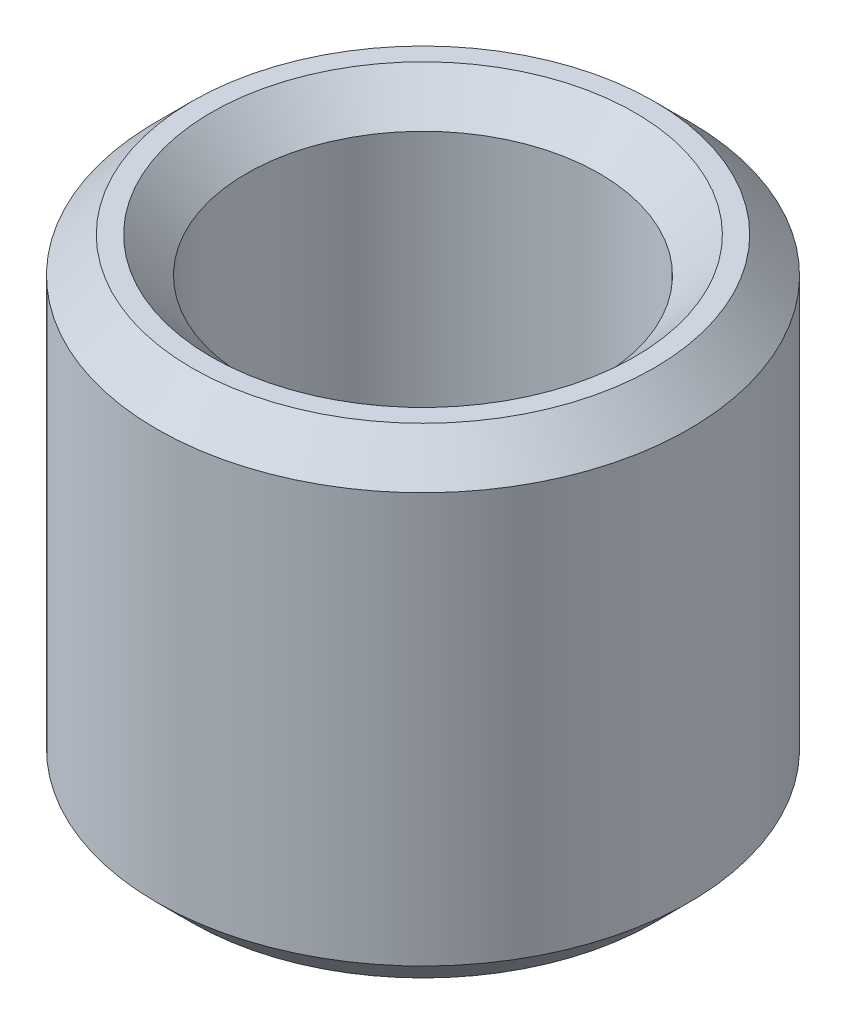
ISO-10303-21;
HEADER;
FILE_DESCRIPTION(('STEP AP214'),'2;1');
FILE_NAME('part.step','',(''),(''),'','','');
FILE_SCHEMA(('AUTOMOTIVE_DESIGN { 1 0 10303 214 1 1 1 1 }'));
ENDSEC;
DATA;
#1=APPLICATION_CONTEXT('core data for automotive mechanical design processes');
#2=APPLICATION_PROTOCOL_DEFINITION('international standard','automotive_design',2000,#1);
#3=PRODUCT_CONTEXT('',#1,'mechanical');
#4=PRODUCT('Part','Part','',(#3));
#5=PRODUCT_RELATED_PRODUCT_CATEGORY('part','',(#4));
#6=PRODUCT_DEFINITION_FORMATION('','',#4);
#7=PRODUCT_DEFINITION_CONTEXT('part definition',#1,'design');
#8=PRODUCT_DEFINITION('design','',#6,#7);
#9=PRODUCT_DEFINITION_SHAPE('','',#8);
#10=(LENGTH_UNIT() NAMED_UNIT(*) SI_UNIT(.MILLI.,.METRE.));
#11=(NAMED_UNIT(*) PLANE_ANGLE_UNIT() SI_UNIT($,.RADIAN.));
#12=(NAMED_UNIT(*) SI_UNIT($,.STERADIAN.) SOLID_ANGLE_UNIT());
#13=UNCERTAINTY_MEASURE_WITH_UNIT(LENGTH_MEASURE(1.E-05),#10,'distance_accuracy_value','');
#14=(GEOMETRIC_REPRESENTATION_CONTEXT(3) GLOBAL_UNCERTAINTY_ASSIGNED_CONTEXT((#13)) GLOBAL_UNIT_ASSIGNED_CONTEXT((#10,
#11,#12)) REPRESENTATION_CONTEXT('',''));
#15=CARTESIAN_POINT('',(0.,0.,0.));
#16=DIRECTION('',(0.,0.,1.));
#17=DIRECTION('',(1.,0.,0.));
#18=AXIS2_PLACEMENT_3D('',#15,#16,#17);
#19=CARTESIAN_POINT('',(0.,27.0609419100916,0.));
#20=DIRECTION('',(0.,-1.,0.));
#21=DIRECTION('',(0.,0.,-1.));
#22=AXIS2_PLACEMENT_3D('',#19,#20,#21);
#23=CYLINDRICAL_SURFACE('',#22,15.);
#24=CARTESIAN_POINT('',(0.,1.9852717542668,0.));
#25=DIRECTION('',(0.,1.,0.));
#26=DIRECTION('',(0.,0.,1.));
#27=AXIS2_PLACEMENT_3D('',#24,#25,#26);
#28=CIRCLE('',#27,15.);
#29=CARTESIAN_POINT('',(0.,1.9852717542668,15.));
#30=VERTEX_POINT('',#29);
#31=EDGE_CURVE('E10',#30,#30,#28,.T.);
#32=ORIENTED_EDGE('',*,*,#31,.T.);
#33=EDGE_LOOP('',(#32));
#34=FACE_BOUND('',#33,.T.);
#35=CARTESIAN_POINT('',(0.,25.0756701558248,0.));
#36=DIRECTION('',(0.,1.,0.));
#37=DIRECTION('',(0.,0.,1.));
#38=AXIS2_PLACEMENT_3D('',#35,#36,#37);
#39=CIRCLE('',#38,15.);
#40=CARTESIAN_POINT('',(0.,25.0756701558248,15.));
#41=VERTEX_POINT('',#40);
#42=EDGE_CURVE('E50',#41,#41,#39,.F.);
#43=ORIENTED_EDGE('',*,*,#42,.T.);
#44=EDGE_LOOP('',(#43));
#45=FACE_BOUND('',#44,.T.);
#46=ADVANCED_FACE('F39',(#34,#45),#23,.T.);
#47=CARTESIAN_POINT('',(0.,27.0609419100916,0.));
#48=DIRECTION('',(0.,1.,0.));
#49=DIRECTION('',(0.,0.,1.));
#50=AXIS2_PLACEMENT_3D('',#47,#48,#49);
#51=PLANE('',#50);
#52=CARTESIAN_POINT('',(0.,27.0609419100916,0.));
#53=DIRECTION('',(0.,1.,0.));
#54=DIRECTION('',(0.,0.,1.));
#55=AXIS2_PLACEMENT_3D('',#52,#53,#54);
#56=CIRCLE('',#55,11.9254574216916);
#57=CARTESIAN_POINT('',(0.,27.0609419100916,11.9254574216916));
#58=VERTEX_POINT('',#57);
#59=EDGE_CURVE('E58',#58,#58,#56,.F.);
#60=ORIENTED_EDGE('',*,*,#59,.T.);
#61=EDGE_LOOP('',(#60));
#62=FACE_BOUND('',#61,.T.);
#63=CARTESIAN_POINT('',(0.,27.0609419100916,0.));
#64=DIRECTION('',(0.,1.,0.));
#65=DIRECTION('',(0.,0.,1.));
#66=AXIS2_PLACEMENT_3D('',#63,#64,#65);
#67=CIRCLE('',#66,13.0147282457332);
#68=CARTESIAN_POINT('',(0.,27.0609419100916,13.0147282457332));
#69=VERTEX_POINT('',#68);
#70=EDGE_CURVE('E61',#69,#69,#67,.T.);
#71=ORIENTED_EDGE('',*,*,#70,.T.);
#72=EDGE_LOOP('',(#71));
#73=FACE_BOUND('',#72,.T.);
#74=ADVANCED_FACE('F88',(#62,#73),#51,.T.);
#75=CARTESIAN_POINT('',(0.,0.,0.));
#76=DIRECTION('',(0.,1.,0.));
#77=DIRECTION('',(0.,0.,1.));
#78=AXIS2_PLACEMENT_3D('',#75,#76,#77);
#79=PLANE('',#78);
#80=CARTESIAN_POINT('',(0.,0.,0.));
#81=DIRECTION('',(0.,1.,0.));
#82=DIRECTION('',(0.,0.,1.));
#83=AXIS2_PLACEMENT_3D('',#80,#81,#82);
#84=CIRCLE('',#83,11.9254574216916);
#85=CARTESIAN_POINT('',(0.,0.,11.9254574216916));
#86=VERTEX_POINT('',#85);
#87=EDGE_CURVE('E51',#86,#86,#84,.T.);
#88=ORIENTED_EDGE('',*,*,#87,.T.);
#89=EDGE_LOOP('',(#88));
#90=FACE_BOUND('',#89,.T.);
#91=CARTESIAN_POINT('',(0.,0.,0.));
#92=DIRECTION('',(0.,1.,0.));
#93=DIRECTION('',(0.,0.,1.));
#94=AXIS2_PLACEMENT_3D('',#91,#92,#93);
#95=CIRCLE('',#94,13.0147282457332);
#96=CARTESIAN_POINT('',(0.,0.,13.0147282457332));
#97=VERTEX_POINT('',#96);
#98=EDGE_CURVE('E54',#97,#97,#95,.F.);
#99=ORIENTED_EDGE('',*,*,#98,.T.);
#100=EDGE_LOOP('',(#99));
#101=FACE_BOUND('',#100,.T.);
#102=ADVANCED_FACE('F83',(#90,#101),#79,.F.);
#103=CARTESIAN_POINT('',(0.,27.0609419100916,0.));
#104=DIRECTION('',(0.,-1.,0.));
#105=DIRECTION('',(0.,0.,-1.));
#106=AXIS2_PLACEMENT_3D('',#103,#104,#105);
#107=CYLINDRICAL_SURFACE('',#106,9.9401856674248);
#108=CARTESIAN_POINT('',(0.,25.0756701558248,0.));
#109=DIRECTION('',(0.,1.,0.));
#110=DIRECTION('',(0.,0.,1.));
#111=AXIS2_PLACEMENT_3D('',#108,#109,#110);
#112=CIRCLE('',#111,9.9401856674248);
#113=CARTESIAN_POINT('',(0.,25.0756701558248,9.9401856674248));
#114=VERTEX_POINT('',#113);
#115=EDGE_CURVE('E67',#114,#114,#112,.T.);
#116=ORIENTED_EDGE('',*,*,#115,.T.);
#117=EDGE_LOOP('',(#116));
#118=FACE_BOUND('',#117,.T.);
#119=CARTESIAN_POINT('',(0.,1.98527175426682,0.));
#120=DIRECTION('',(0.,1.,0.));
#121=DIRECTION('',(0.,0.,1.));
#122=AXIS2_PLACEMENT_3D('',#119,#120,#121);
#123=CIRCLE('',#122,9.9401856674248);
#124=CARTESIAN_POINT('',(0.,1.98527175426682,9.9401856674248));
#125=VERTEX_POINT('',#124);
#126=EDGE_CURVE('E69',#125,#125,#123,.F.);
#127=ORIENTED_EDGE('',*,*,#126,.T.);
#128=EDGE_LOOP('',(#127));
#129=FACE_BOUND('',#128,.T.);
#130=ADVANCED_FACE('F71',(#118,#129),#107,.F.);
#131=CARTESIAN_POINT('',(0.,25.0756701558248,0.));
#132=DIRECTION('',(0.,1.,0.));
#133=DIRECTION('',(0.,0.,1.));
#134=AXIS2_PLACEMENT_3D('',#131,#132,#133);
#135=CONICAL_SURFACE('',#134,9.9401856674248,0.785398163397451);
#136=ORIENTED_EDGE('',*,*,#59,.F.);
#137=EDGE_LOOP('',(#136));
#138=FACE_BOUND('',#137,.T.);
#139=ORIENTED_EDGE('',*,*,#115,.F.);
#140=EDGE_LOOP('',(#139));
#141=FACE_BOUND('',#140,.T.);
#142=ADVANCED_FACE('F77',(#138,#141),#135,.F.);
#143=CARTESIAN_POINT('',(0.,0.,0.));
#144=DIRECTION('',(0.,-1.,0.));
#145=DIRECTION('',(0.,0.,-1.));
#146=AXIS2_PLACEMENT_3D('',#143,#144,#145);
#147=CONICAL_SURFACE('',#146,11.9254574216916,0.785398163397443);
#148=ORIENTED_EDGE('',*,*,#126,.F.);
#149=EDGE_LOOP('',(#148));
#150=FACE_BOUND('',#149,.T.);
#151=ORIENTED_EDGE('',*,*,#87,.F.);
#152=EDGE_LOOP('',(#151));
#153=FACE_BOUND('',#152,.T.);
#154=ADVANCED_FACE('F73',(#150,#153),#147,.F.);
#155=CARTESIAN_POINT('',(0.,1.9852717542668,0.));
#156=DIRECTION('',(0.,1.,0.));
#157=DIRECTION('',(0.,0.,1.));
#158=AXIS2_PLACEMENT_3D('',#155,#156,#157);
#159=CONICAL_SURFACE('',#158,15.,0.785398163397453);
#160=ORIENTED_EDGE('',*,*,#98,.F.);
#161=EDGE_LOOP('',(#160));
#162=FACE_BOUND('',#161,.T.);
#163=ORIENTED_EDGE('',*,*,#31,.F.);
#164=EDGE_LOOP('',(#163));
#165=FACE_BOUND('',#164,.T.);
#166=ADVANCED_FACE('F76',(#162,#165),#159,.T.);
#167=CARTESIAN_POINT('',(0.,27.0609419100916,0.));
#168=DIRECTION('',(0.,-1.,0.));
#169=DIRECTION('',(0.,0.,-1.));
#170=AXIS2_PLACEMENT_3D('',#167,#168,#169);
#171=CONICAL_SURFACE('',#170,13.0147282457332,0.785398163397443);
#172=ORIENTED_EDGE('',*,*,#42,.F.);
#173=EDGE_LOOP('',(#172));
#174=FACE_BOUND('',#173,.T.);
#175=ORIENTED_EDGE('',*,*,#70,.F.);
#176=EDGE_LOOP('',(#175));
#177=FACE_BOUND('',#176,.T.);
#178=ADVANCED_FACE('F45',(#174,#177),#171,.T.);
#179=CLOSED_SHELL('',(#46,#74,#102,#130,#142,#154,#166,#178));
#180=MANIFOLD_SOLID_BREP('B2',#179);
#181=ADVANCED_BREP_SHAPE_REPRESENTATION('',(#18,#180),#14);
#182=SHAPE_DEFINITION_REPRESENTATION(#9,#181);
ENDSEC;
END-ISO-10303-21;
